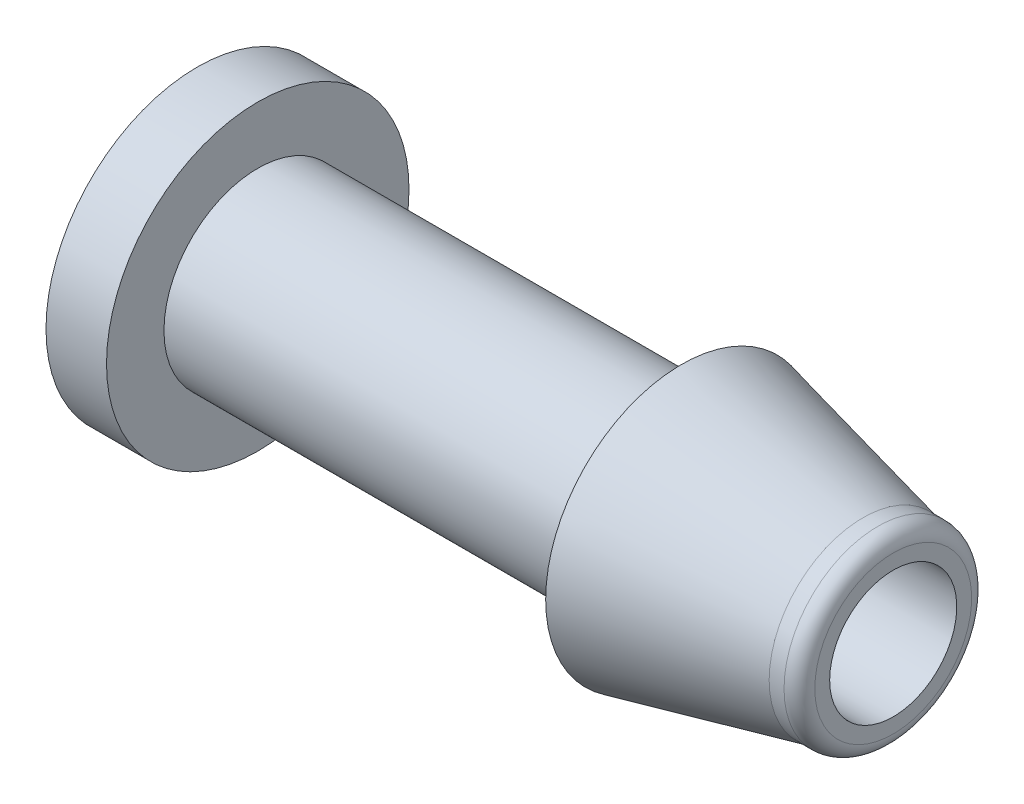
ISO-10303-21;
HEADER;
FILE_DESCRIPTION(('STEP AP214'),'2;1');
FILE_NAME('part.step','',(''),(''),'','','');
FILE_SCHEMA(('AUTOMOTIVE_DESIGN { 1 0 10303 214 1 1 1 1 }'));
ENDSEC;
DATA;
#1=APPLICATION_CONTEXT('core data for automotive mechanical design processes');
#2=APPLICATION_PROTOCOL_DEFINITION('international standard','automotive_design',2000,#1);
#3=PRODUCT_CONTEXT('',#1,'mechanical');
#4=PRODUCT('Part','Part','',(#3));
#5=PRODUCT_RELATED_PRODUCT_CATEGORY('part','',(#4));
#6=PRODUCT_DEFINITION_FORMATION('','',#4);
#7=PRODUCT_DEFINITION_CONTEXT('part definition',#1,'design');
#8=PRODUCT_DEFINITION('design','',#6,#7);
#9=PRODUCT_DEFINITION_SHAPE('','',#8);
#10=(LENGTH_UNIT() NAMED_UNIT(*) SI_UNIT(.MILLI.,.METRE.));
#11=(NAMED_UNIT(*) PLANE_ANGLE_UNIT() SI_UNIT($,.RADIAN.));
#12=(NAMED_UNIT(*) SI_UNIT($,.STERADIAN.) SOLID_ANGLE_UNIT());
#13=UNCERTAINTY_MEASURE_WITH_UNIT(LENGTH_MEASURE(1.E-05),#10,'distance_accuracy_value','');
#14=(GEOMETRIC_REPRESENTATION_CONTEXT(3) GLOBAL_UNCERTAINTY_ASSIGNED_CONTEXT((#13)) GLOBAL_UNIT_ASSIGNED_CONTEXT((#10,
#11,#12)) REPRESENTATION_CONTEXT('',''));
#15=CARTESIAN_POINT('',(0.,0.,0.));
#16=DIRECTION('',(0.,0.,1.));
#17=DIRECTION('',(1.,0.,0.));
#18=AXIS2_PLACEMENT_3D('',#15,#16,#17);
#19=CARTESIAN_POINT('',(0.,0.,0.));
#20=DIRECTION('',(-1.,0.,0.));
#21=DIRECTION('',(0.,0.,1.));
#22=AXIS2_PLACEMENT_3D('',#19,#20,#21);
#23=CYLINDRICAL_SURFACE('',#22,2.1);
#24=CARTESIAN_POINT('',(21.,0.,0.));
#25=DIRECTION('',(-1.,0.,0.));
#26=DIRECTION('',(0.,0.,1.));
#27=AXIS2_PLACEMENT_3D('',#24,#25,#26);
#28=CIRCLE('',#27,2.1);
#29=CARTESIAN_POINT('',(21.,0.,2.1));
#30=VERTEX_POINT('',#29);
#31=EDGE_CURVE('E10',#30,#30,#28,.T.);
#32=ORIENTED_EDGE('',*,*,#31,.F.);
#33=EDGE_LOOP('',(#32));
#34=FACE_BOUND('',#33,.T.);
#35=CARTESIAN_POINT('',(-2.,0.,0.));
#36=DIRECTION('',(-1.,0.,0.));
#37=DIRECTION('',(0.,0.,1.));
#38=AXIS2_PLACEMENT_3D('',#35,#36,#37);
#39=CIRCLE('',#38,2.1);
#40=CARTESIAN_POINT('',(-2.,0.,2.1));
#41=VERTEX_POINT('',#40);
#42=EDGE_CURVE('E77',#41,#41,#39,.T.);
#43=ORIENTED_EDGE('',*,*,#42,.T.);
#44=EDGE_LOOP('',(#43));
#45=FACE_BOUND('',#44,.T.);
#46=ADVANCED_FACE('F37',(#34,#45),#23,.F.);
#47=CARTESIAN_POINT('',(21.,2.592,0.));
#48=DIRECTION('',(-1.,0.,0.));
#49=DIRECTION('',(0.,0.,1.));
#50=AXIS2_PLACEMENT_3D('',#47,#48,#49);
#51=PLANE('',#50);
#52=CARTESIAN_POINT('',(21.,0.,0.));
#53=DIRECTION('',(-1.,0.,0.));
#54=DIRECTION('',(0.,0.,1.));
#55=AXIS2_PLACEMENT_3D('',#52,#53,#54);
#56=CIRCLE('',#55,2.592);
#57=CARTESIAN_POINT('',(21.,0.,2.592));
#58=VERTEX_POINT('',#57);
#59=EDGE_CURVE('E44',#58,#58,#56,.T.);
#60=ORIENTED_EDGE('',*,*,#59,.F.);
#61=EDGE_LOOP('',(#60));
#62=FACE_BOUND('',#61,.T.);
#63=ORIENTED_EDGE('',*,*,#31,.T.);
#64=EDGE_LOOP('',(#63));
#65=FACE_BOUND('',#64,.T.);
#66=ADVANCED_FACE('F103',(#62,#65),#51,.F.);
#67=CARTESIAN_POINT('',(20.492,0.,0.));
#68=DIRECTION('',(-1.,0.,0.));
#69=DIRECTION('',(0.,0.,1.));
#70=AXIS2_PLACEMENT_3D('',#67,#68,#69);
#71=TOROIDAL_SURFACE('',#70,2.592,0.508000000000002);
#72=CARTESIAN_POINT('',(20.492,0.,0.));
#73=DIRECTION('',(-1.,0.,0.));
#74=DIRECTION('',(0.,0.,1.));
#75=AXIS2_PLACEMENT_3D('',#72,#73,#74);
#76=CIRCLE('',#75,3.1);
#77=CARTESIAN_POINT('',(20.492,0.,3.1));
#78=VERTEX_POINT('',#77);
#79=EDGE_CURVE('E49',#78,#78,#76,.T.);
#80=ORIENTED_EDGE('',*,*,#79,.F.);
#81=EDGE_LOOP('',(#80));
#82=FACE_BOUND('',#81,.T.);
#83=ORIENTED_EDGE('',*,*,#59,.T.);
#84=EDGE_LOOP('',(#83));
#85=FACE_BOUND('',#84,.T.);
#86=ADVANCED_FACE('F108',(#82,#85),#71,.T.);
#87=CARTESIAN_POINT('',(0.,0.,0.));
#88=DIRECTION('',(-1.,0.,0.));
#89=DIRECTION('',(0.,0.,1.));
#90=AXIS2_PLACEMENT_3D('',#87,#88,#89);
#91=CYLINDRICAL_SURFACE('',#90,3.1);
#92=CARTESIAN_POINT('',(20.,0.,0.));
#93=DIRECTION('',(-1.,0.,0.));
#94=DIRECTION('',(0.,0.,1.));
#95=AXIS2_PLACEMENT_3D('',#92,#93,#94);
#96=CIRCLE('',#95,3.1);
#97=CARTESIAN_POINT('',(20.,0.,3.1));
#98=VERTEX_POINT('',#97);
#99=EDGE_CURVE('E54',#98,#98,#96,.T.);
#100=ORIENTED_EDGE('',*,*,#99,.F.);
#101=EDGE_LOOP('',(#100));
#102=FACE_BOUND('',#101,.T.);
#103=ORIENTED_EDGE('',*,*,#79,.T.);
#104=EDGE_LOOP('',(#103));
#105=FACE_BOUND('',#104,.T.);
#106=ADVANCED_FACE('F113',(#102,#105),#91,.T.);
#107=CARTESIAN_POINT('',(20.,0.,0.));
#108=DIRECTION('',(-1.,0.,0.));
#109=DIRECTION('',(0.,0.,1.));
#110=AXIS2_PLACEMENT_3D('',#107,#108,#109);
#111=CONICAL_SURFACE('',#110,3.1,0.226892802759263);
#112=CARTESIAN_POINT('',(14.,0.,0.));
#113=DIRECTION('',(-1.,0.,0.));
#114=DIRECTION('',(0.,0.,1.));
#115=AXIS2_PLACEMENT_3D('',#112,#113,#114);
#116=CIRCLE('',#115,4.48520914675338);
#117=CARTESIAN_POINT('',(14.,0.,4.48520914675338));
#118=VERTEX_POINT('',#117);
#119=EDGE_CURVE('E60',#118,#118,#116,.T.);
#120=ORIENTED_EDGE('',*,*,#119,.F.);
#121=EDGE_LOOP('',(#120));
#122=FACE_BOUND('',#121,.T.);
#123=ORIENTED_EDGE('',*,*,#99,.T.);
#124=EDGE_LOOP('',(#123));
#125=FACE_BOUND('',#124,.T.);
#126=ADVANCED_FACE('F119',(#122,#125),#111,.T.);
#127=CARTESIAN_POINT('',(14.,3.1,0.));
#128=DIRECTION('',(1.,0.,0.));
#129=DIRECTION('',(0.,0.,-1.));
#130=AXIS2_PLACEMENT_3D('',#127,#128,#129);
#131=PLANE('',#130);
#132=CARTESIAN_POINT('',(14.,0.,0.));
#133=DIRECTION('',(-1.,0.,0.));
#134=DIRECTION('',(0.,0.,1.));
#135=AXIS2_PLACEMENT_3D('',#132,#133,#134);
#136=CIRCLE('',#135,3.1);
#137=CARTESIAN_POINT('',(14.,0.,3.1));
#138=VERTEX_POINT('',#137);
#139=EDGE_CURVE('E64',#138,#138,#136,.T.);
#140=ORIENTED_EDGE('',*,*,#139,.F.);
#141=EDGE_LOOP('',(#140));
#142=FACE_BOUND('',#141,.T.);
#143=ORIENTED_EDGE('',*,*,#119,.T.);
#144=EDGE_LOOP('',(#143));
#145=FACE_BOUND('',#144,.T.);
#146=ADVANCED_FACE('F99',(#142,#145),#131,.F.);
#147=CARTESIAN_POINT('',(0.,0.,0.));
#148=DIRECTION('',(-1.,0.,0.));
#149=DIRECTION('',(0.,0.,1.));
#150=AXIS2_PLACEMENT_3D('',#147,#148,#149);
#151=CYLINDRICAL_SURFACE('',#150,3.1);
#152=CARTESIAN_POINT('',(0.,0.,0.));
#153=DIRECTION('',(-1.,0.,0.));
#154=DIRECTION('',(0.,0.,1.));
#155=AXIS2_PLACEMENT_3D('',#152,#153,#154);
#156=CIRCLE('',#155,3.1);
#157=CARTESIAN_POINT('',(0.,0.,3.1));
#158=VERTEX_POINT('',#157);
#159=EDGE_CURVE('E68',#158,#158,#156,.T.);
#160=ORIENTED_EDGE('',*,*,#159,.F.);
#161=EDGE_LOOP('',(#160));
#162=FACE_BOUND('',#161,.T.);
#163=ORIENTED_EDGE('',*,*,#139,.T.);
#164=EDGE_LOOP('',(#163));
#165=FACE_BOUND('',#164,.T.);
#166=ADVANCED_FACE('F89',(#162,#165),#151,.T.);
#167=CARTESIAN_POINT('',(-2.,0.,0.));
#168=DIRECTION('',(-1.,0.,0.));
#169=DIRECTION('',(0.,0.,1.));
#170=AXIS2_PLACEMENT_3D('',#167,#168,#169);
#171=PLANE('',#170);
#172=CARTESIAN_POINT('',(-2.,0.,0.));
#173=DIRECTION('',(-1.,0.,0.));
#174=DIRECTION('',(0.,0.,1.));
#175=AXIS2_PLACEMENT_3D('',#172,#173,#174);
#176=CIRCLE('',#175,4.99790373054634);
#177=CARTESIAN_POINT('',(-2.,0.,4.99790373054634));
#178=VERTEX_POINT('',#177);
#179=EDGE_CURVE('E72',#178,#178,#176,.T.);
#180=ORIENTED_EDGE('',*,*,#179,.T.);
#181=EDGE_LOOP('',(#180));
#182=FACE_BOUND('',#181,.T.);
#183=ORIENTED_EDGE('',*,*,#42,.F.);
#184=EDGE_LOOP('',(#183));
#185=FACE_BOUND('',#184,.T.);
#186=ADVANCED_FACE('F86',(#182,#185),#171,.T.);
#187=CARTESIAN_POINT('',(0.,0.,0.));
#188=DIRECTION('',(-1.,0.,0.));
#189=DIRECTION('',(0.,0.,1.));
#190=AXIS2_PLACEMENT_3D('',#187,#188,#189);
#191=PLANE('',#190);
#192=ORIENTED_EDGE('',*,*,#159,.T.);
#193=EDGE_LOOP('',(#192));
#194=FACE_BOUND('',#193,.T.);
#195=CARTESIAN_POINT('',(0.,0.,0.));
#196=DIRECTION('',(-1.,0.,0.));
#197=DIRECTION('',(0.,0.,1.));
#198=AXIS2_PLACEMENT_3D('',#195,#196,#197);
#199=CIRCLE('',#198,4.99790373054634);
#200=CARTESIAN_POINT('',(0.,0.,4.99790373054634));
#201=VERTEX_POINT('',#200);
#202=EDGE_CURVE('E73',#201,#201,#199,.T.);
#203=ORIENTED_EDGE('',*,*,#202,.F.);
#204=EDGE_LOOP('',(#203));
#205=FACE_BOUND('',#204,.T.);
#206=ADVANCED_FACE('F88',(#194,#205),#191,.F.);
#207=CARTESIAN_POINT('',(-2.,0.,0.));
#208=DIRECTION('',(1.,0.,0.));
#209=DIRECTION('',(0.,0.,-1.));
#210=AXIS2_PLACEMENT_3D('',#207,#208,#209);
#211=CYLINDRICAL_SURFACE('',#210,4.99790373054634);
#212=ORIENTED_EDGE('',*,*,#179,.F.);
#213=EDGE_LOOP('',(#212));
#214=FACE_BOUND('',#213,.T.);
#215=ORIENTED_EDGE('',*,*,#202,.T.);
#216=EDGE_LOOP('',(#215));
#217=FACE_BOUND('',#216,.T.);
#218=ADVANCED_FACE('F96',(#214,#217),#211,.T.);
#219=CLOSED_SHELL('',(#46,#66,#86,#106,#126,#146,#166,#186,#206,#218));
#220=MANIFOLD_SOLID_BREP('B2',#219);
#221=ADVANCED_BREP_SHAPE_REPRESENTATION('',(#18,#220),#14);
#222=SHAPE_DEFINITION_REPRESENTATION(#9,#221);
ENDSEC;
END-ISO-10303-21;
